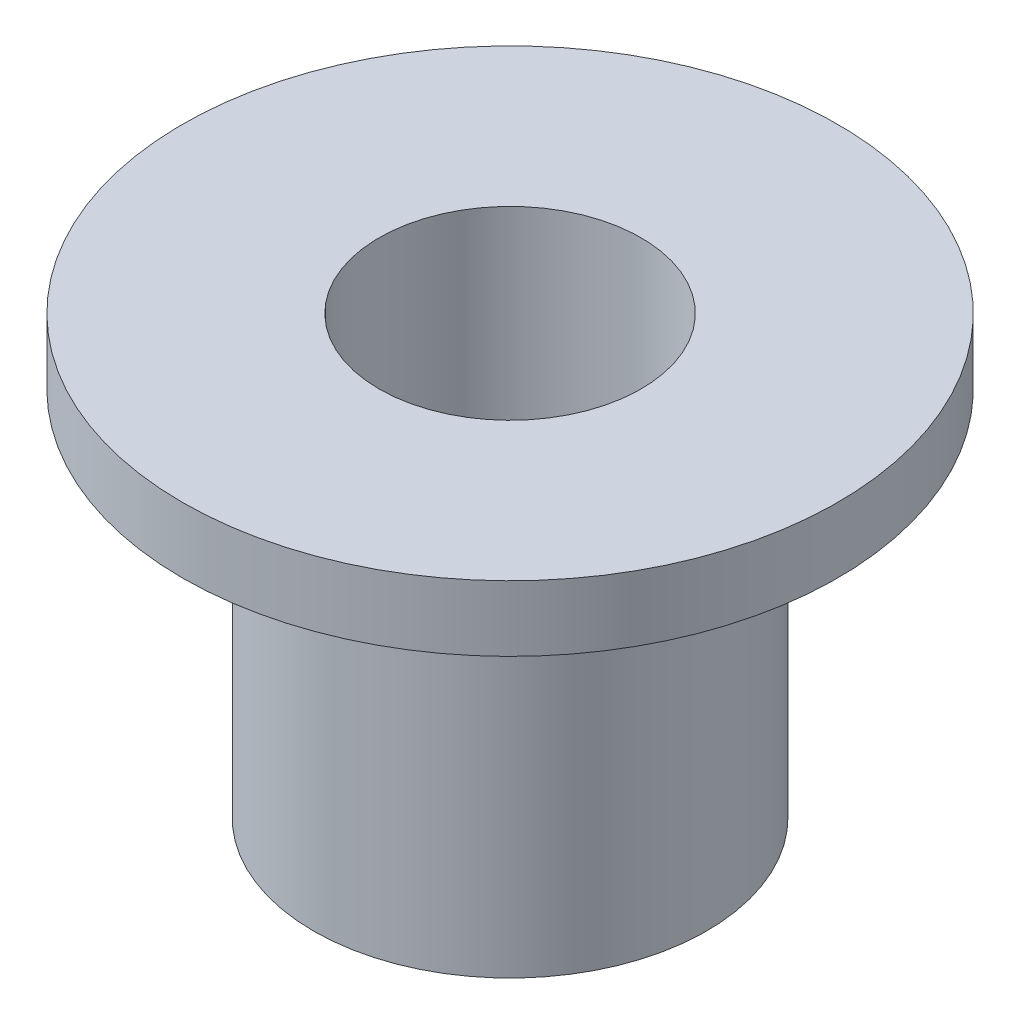
ISO-10303-21;
HEADER;
FILE_DESCRIPTION(('STEP AP214'),'2;1');
FILE_NAME('part.step','',(''),(''),'','','');
FILE_SCHEMA(('AUTOMOTIVE_DESIGN { 1 0 10303 214 1 1 1 1 }'));
ENDSEC;
DATA;
#1=APPLICATION_CONTEXT('core data for automotive mechanical design processes');
#2=APPLICATION_PROTOCOL_DEFINITION('international standard','automotive_design',2000,#1);
#3=PRODUCT_CONTEXT('',#1,'mechanical');
#4=PRODUCT('Part','Part','',(#3));
#5=PRODUCT_RELATED_PRODUCT_CATEGORY('part','',(#4));
#6=PRODUCT_DEFINITION_FORMATION('','',#4);
#7=PRODUCT_DEFINITION_CONTEXT('part definition',#1,'design');
#8=PRODUCT_DEFINITION('design','',#6,#7);
#9=PRODUCT_DEFINITION_SHAPE('','',#8);
#10=(LENGTH_UNIT() NAMED_UNIT(*) SI_UNIT(.MILLI.,.METRE.));
#11=(NAMED_UNIT(*) PLANE_ANGLE_UNIT() SI_UNIT($,.RADIAN.));
#12=(NAMED_UNIT(*) SI_UNIT($,.STERADIAN.) SOLID_ANGLE_UNIT());
#13=UNCERTAINTY_MEASURE_WITH_UNIT(LENGTH_MEASURE(1.E-05),#10,'distance_accuracy_value','');
#14=(GEOMETRIC_REPRESENTATION_CONTEXT(3) GLOBAL_UNCERTAINTY_ASSIGNED_CONTEXT((#13)) GLOBAL_UNIT_ASSIGNED_CONTEXT((#10,
#11,#12)) REPRESENTATION_CONTEXT('',''));
#15=CARTESIAN_POINT('',(0.,0.,0.));
#16=DIRECTION('',(0.,0.,1.));
#17=DIRECTION('',(1.,0.,0.));
#18=AXIS2_PLACEMENT_3D('',#15,#16,#17);
#19=CARTESIAN_POINT('',(0.,0.75,0.));
#20=DIRECTION('',(0.,1.,0.));
#21=DIRECTION('',(0.,0.,1.));
#22=AXIS2_PLACEMENT_3D('',#19,#20,#21);
#23=PLANE('',#22);
#24=CARTESIAN_POINT('',(0.,0.75,0.));
#25=DIRECTION('',(0.,1.,0.));
#26=DIRECTION('',(0.,0.,1.));
#27=AXIS2_PLACEMENT_3D('',#24,#25,#26);
#28=CIRCLE('',#27,3.75);
#29=CARTESIAN_POINT('',(0.,0.75,3.75));
#30=VERTEX_POINT('',#29);
#31=EDGE_CURVE('E10',#30,#30,#28,.T.);
#32=ORIENTED_EDGE('',*,*,#31,.T.);
#33=EDGE_LOOP('',(#32));
#34=FACE_BOUND('',#33,.T.);
#35=CARTESIAN_POINT('',(0.,0.75,0.));
#36=DIRECTION('',(0.,1.,0.));
#37=DIRECTION('',(0.,0.,1.));
#38=AXIS2_PLACEMENT_3D('',#35,#36,#37);
#39=CIRCLE('',#38,1.5);
#40=CARTESIAN_POINT('',(0.,0.75,1.5));
#41=VERTEX_POINT('',#40);
#42=EDGE_CURVE('E43',#41,#41,#39,.T.);
#43=ORIENTED_EDGE('',*,*,#42,.F.);
#44=EDGE_LOOP('',(#43));
#45=FACE_BOUND('',#44,.T.);
#46=ADVANCED_FACE('F30',(#34,#45),#23,.T.);
#47=CARTESIAN_POINT('',(0.,0.,0.));
#48=DIRECTION('',(0.,1.,0.));
#49=DIRECTION('',(0.,0.,1.));
#50=AXIS2_PLACEMENT_3D('',#47,#48,#49);
#51=PLANE('',#50);
#52=CARTESIAN_POINT('',(0.,0.,0.));
#53=DIRECTION('',(0.,1.,0.));
#54=DIRECTION('',(0.,0.,1.));
#55=AXIS2_PLACEMENT_3D('',#52,#53,#54);
#56=CIRCLE('',#55,2.25);
#57=CARTESIAN_POINT('',(0.,0.,2.25));
#58=VERTEX_POINT('',#57);
#59=EDGE_CURVE('E34',#58,#58,#56,.T.);
#60=ORIENTED_EDGE('',*,*,#59,.T.);
#61=EDGE_LOOP('',(#60));
#62=FACE_BOUND('',#61,.T.);
#63=CARTESIAN_POINT('',(0.,0.,0.));
#64=DIRECTION('',(0.,1.,0.));
#65=DIRECTION('',(0.,0.,1.));
#66=AXIS2_PLACEMENT_3D('',#63,#64,#65);
#67=CIRCLE('',#66,3.75);
#68=CARTESIAN_POINT('',(0.,0.,3.75));
#69=VERTEX_POINT('',#68);
#70=EDGE_CURVE('E38',#69,#69,#67,.T.);
#71=ORIENTED_EDGE('',*,*,#70,.F.);
#72=EDGE_LOOP('',(#71));
#73=FACE_BOUND('',#72,.T.);
#74=ADVANCED_FACE('F68',(#62,#73),#51,.F.);
#75=CARTESIAN_POINT('',(0.,0.75,0.));
#76=DIRECTION('',(0.,-1.,0.));
#77=DIRECTION('',(0.,0.,-1.));
#78=AXIS2_PLACEMENT_3D('',#75,#76,#77);
#79=CYLINDRICAL_SURFACE('',#78,3.75);
#80=ORIENTED_EDGE('',*,*,#31,.F.);
#81=EDGE_LOOP('',(#80));
#82=FACE_BOUND('',#81,.T.);
#83=ORIENTED_EDGE('',*,*,#70,.T.);
#84=EDGE_LOOP('',(#83));
#85=FACE_BOUND('',#84,.T.);
#86=ADVANCED_FACE('F32',(#82,#85),#79,.T.);
#87=CARTESIAN_POINT('',(0.,0.75,0.));
#88=DIRECTION('',(0.,-1.,0.));
#89=DIRECTION('',(0.,0.,-1.));
#90=AXIS2_PLACEMENT_3D('',#87,#88,#89);
#91=CYLINDRICAL_SURFACE('',#90,1.5);
#92=ORIENTED_EDGE('',*,*,#42,.T.);
#93=EDGE_LOOP('',(#92));
#94=FACE_BOUND('',#93,.T.);
#95=CARTESIAN_POINT('',(0.,-4.25,0.));
#96=DIRECTION('',(0.,1.,0.));
#97=DIRECTION('',(0.,0.,1.));
#98=AXIS2_PLACEMENT_3D('',#95,#96,#97);
#99=CIRCLE('',#98,1.5);
#100=CARTESIAN_POINT('',(0.,-4.25,1.5));
#101=VERTEX_POINT('',#100);
#102=EDGE_CURVE('E50',#101,#101,#99,.T.);
#103=ORIENTED_EDGE('',*,*,#102,.F.);
#104=EDGE_LOOP('',(#103));
#105=FACE_BOUND('',#104,.T.);
#106=ADVANCED_FACE('F57',(#94,#105),#91,.F.);
#107=CARTESIAN_POINT('',(0.,-4.25,0.));
#108=DIRECTION('',(0.,1.,0.));
#109=DIRECTION('',(0.,0.,1.));
#110=AXIS2_PLACEMENT_3D('',#107,#108,#109);
#111=CYLINDRICAL_SURFACE('',#110,2.25);
#112=CARTESIAN_POINT('',(0.,-4.25,0.));
#113=DIRECTION('',(0.,1.,0.));
#114=DIRECTION('',(0.,0.,1.));
#115=AXIS2_PLACEMENT_3D('',#112,#113,#114);
#116=CIRCLE('',#115,2.25);
#117=CARTESIAN_POINT('',(0.,-4.25,2.25));
#118=VERTEX_POINT('',#117);
#119=EDGE_CURVE('E47',#118,#118,#116,.T.);
#120=ORIENTED_EDGE('',*,*,#119,.T.);
#121=EDGE_LOOP('',(#120));
#122=FACE_BOUND('',#121,.T.);
#123=ORIENTED_EDGE('',*,*,#59,.F.);
#124=EDGE_LOOP('',(#123));
#125=FACE_BOUND('',#124,.T.);
#126=ADVANCED_FACE('F59',(#122,#125),#111,.T.);
#127=CARTESIAN_POINT('',(0.,-4.25,0.));
#128=DIRECTION('',(0.,1.,0.));
#129=DIRECTION('',(0.,0.,1.));
#130=AXIS2_PLACEMENT_3D('',#127,#128,#129);
#131=PLANE('',#130);
#132=ORIENTED_EDGE('',*,*,#102,.T.);
#133=EDGE_LOOP('',(#132));
#134=FACE_BOUND('',#133,.T.);
#135=ORIENTED_EDGE('',*,*,#119,.F.);
#136=EDGE_LOOP('',(#135));
#137=FACE_BOUND('',#136,.T.);
#138=ADVANCED_FACE('F54',(#134,#137),#131,.F.);
#139=CLOSED_SHELL('',(#46,#74,#86,#106,#126,#138));
#140=MANIFOLD_SOLID_BREP('B2',#139);
#141=ADVANCED_BREP_SHAPE_REPRESENTATION('',(#18,#140),#14);
#142=SHAPE_DEFINITION_REPRESENTATION(#9,#141);
ENDSEC;
END-ISO-10303-21;
